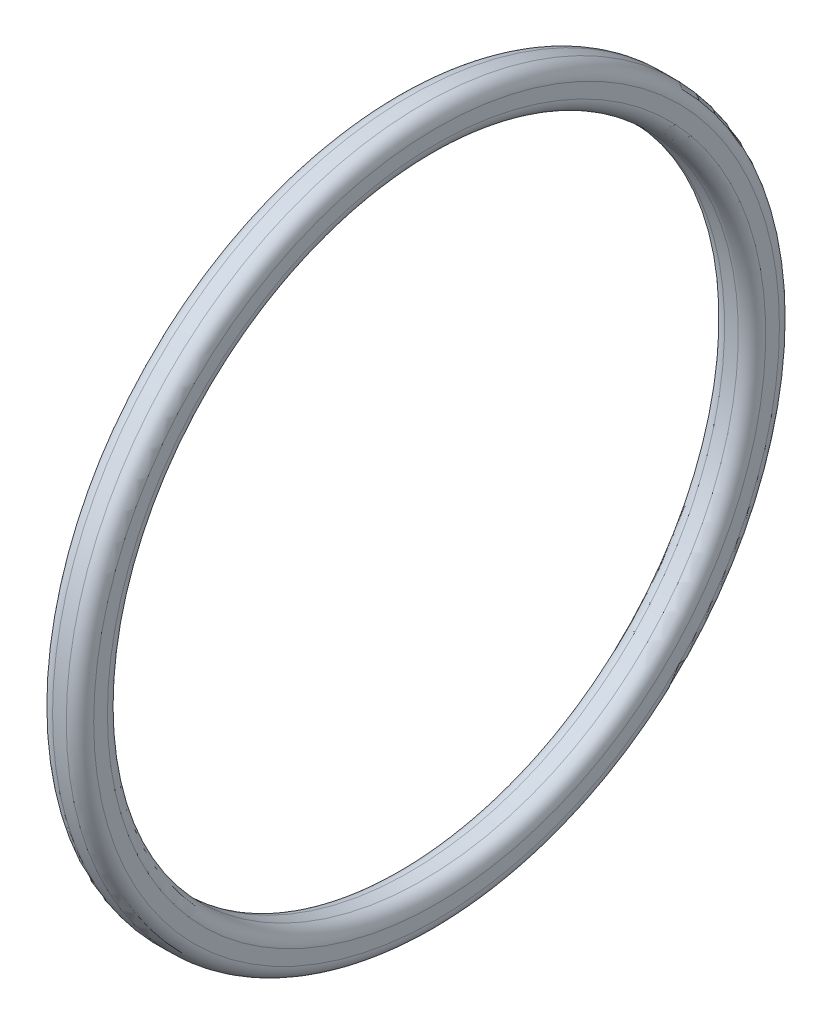
ISO-10303-21;
HEADER;
FILE_DESCRIPTION(('STEP AP214'),'2;1');
FILE_NAME('part.step','',(''),(''),'','','');
FILE_SCHEMA(('AUTOMOTIVE_DESIGN { 1 0 10303 214 1 1 1 1 }'));
ENDSEC;
DATA;
#1=APPLICATION_CONTEXT('core data for automotive mechanical design processes');
#2=APPLICATION_PROTOCOL_DEFINITION('international standard','automotive_design',2000,#1);
#3=PRODUCT_CONTEXT('',#1,'mechanical');
#4=PRODUCT('Part','Part','',(#3));
#5=PRODUCT_RELATED_PRODUCT_CATEGORY('part','',(#4));
#6=PRODUCT_DEFINITION_FORMATION('','',#4);
#7=PRODUCT_DEFINITION_CONTEXT('part definition',#1,'design');
#8=PRODUCT_DEFINITION('design','',#6,#7);
#9=PRODUCT_DEFINITION_SHAPE('','',#8);
#10=(LENGTH_UNIT() NAMED_UNIT(*) SI_UNIT(.MILLI.,.METRE.));
#11=(NAMED_UNIT(*) PLANE_ANGLE_UNIT() SI_UNIT($,.RADIAN.));
#12=(NAMED_UNIT(*) SI_UNIT($,.STERADIAN.) SOLID_ANGLE_UNIT());
#13=UNCERTAINTY_MEASURE_WITH_UNIT(LENGTH_MEASURE(1.E-05),#10,'distance_accuracy_value','');
#14=(GEOMETRIC_REPRESENTATION_CONTEXT(3) GLOBAL_UNCERTAINTY_ASSIGNED_CONTEXT((#13)) GLOBAL_UNIT_ASSIGNED_CONTEXT((#10,
#11,#12)) REPRESENTATION_CONTEXT('',''));
#15=CARTESIAN_POINT('',(0.,0.,0.));
#16=DIRECTION('',(0.,0.,1.));
#17=DIRECTION('',(1.,0.,0.));
#18=AXIS2_PLACEMENT_3D('',#15,#16,#17);
#19=CARTESIAN_POINT('',(1.,0.,0.));
#20=DIRECTION('',(-1.,0.,0.));
#21=DIRECTION('',(0.,0.,1.));
#22=AXIS2_PLACEMENT_3D('',#19,#20,#21);
#23=TOROIDAL_SURFACE('',#22,12.,0.5);
#24=CARTESIAN_POINT('',(1.5,0.,0.));
#25=DIRECTION('',(-1.,0.,0.));
#26=DIRECTION('',(0.,0.,1.));
#27=AXIS2_PLACEMENT_3D('',#24,#25,#26);
#28=CIRCLE('',#27,12.);
#29=CARTESIAN_POINT('',(1.5,0.,12.));
#30=VERTEX_POINT('',#29);
#31=EDGE_CURVE('E56',#30,#30,#28,.T.);
#32=ORIENTED_EDGE('',*,*,#31,.F.);
#33=EDGE_LOOP('',(#32));
#34=FACE_BOUND('',#33,.T.);
#35=CARTESIAN_POINT('',(1.,0.,0.));
#36=DIRECTION('',(-1.,0.,0.));
#37=DIRECTION('',(0.,0.,1.));
#38=AXIS2_PLACEMENT_3D('',#35,#36,#37);
#39=CIRCLE('',#38,11.5);
#40=CARTESIAN_POINT('',(1.,0.,11.5));
#41=VERTEX_POINT('',#40);
#42=EDGE_CURVE('E10',#41,#41,#39,.T.);
#43=ORIENTED_EDGE('',*,*,#42,.T.);
#44=EDGE_LOOP('',(#43));
#45=FACE_BOUND('',#44,.T.);
#46=ADVANCED_FACE('F28',(#34,#45),#23,.T.);
#47=CARTESIAN_POINT('',(-12.3320364238411,0.,0.));
#48=DIRECTION('',(-1.,0.,0.));
#49=DIRECTION('',(0.,0.,1.));
#50=AXIS2_PLACEMENT_3D('',#47,#48,#49);
#51=CYLINDRICAL_SURFACE('',#50,11.5);
#52=ORIENTED_EDGE('',*,*,#42,.F.);
#53=EDGE_LOOP('',(#52));
#54=FACE_BOUND('',#53,.T.);
#55=CARTESIAN_POINT('',(0.5,0.,0.));
#56=DIRECTION('',(-1.,0.,0.));
#57=DIRECTION('',(0.,0.,1.));
#58=AXIS2_PLACEMENT_3D('',#55,#56,#57);
#59=CIRCLE('',#58,11.5);
#60=CARTESIAN_POINT('',(0.5,0.,11.5));
#61=VERTEX_POINT('',#60);
#62=EDGE_CURVE('E34',#61,#61,#59,.T.);
#63=ORIENTED_EDGE('',*,*,#62,.T.);
#64=EDGE_LOOP('',(#63));
#65=FACE_BOUND('',#64,.T.);
#66=ADVANCED_FACE('F63',(#54,#65),#51,.F.);
#67=CARTESIAN_POINT('',(0.5,0.,0.));
#68=DIRECTION('',(-1.,0.,0.));
#69=DIRECTION('',(0.,0.,1.));
#70=AXIS2_PLACEMENT_3D('',#67,#68,#69);
#71=TOROIDAL_SURFACE('',#70,12.,0.5);
#72=ORIENTED_EDGE('',*,*,#62,.F.);
#73=EDGE_LOOP('',(#72));
#74=FACE_BOUND('',#73,.T.);
#75=CARTESIAN_POINT('',(0.,0.,0.));
#76=DIRECTION('',(-1.,0.,0.));
#77=DIRECTION('',(0.,0.,1.));
#78=AXIS2_PLACEMENT_3D('',#75,#76,#77);
#79=CIRCLE('',#78,12.);
#80=CARTESIAN_POINT('',(0.,0.,12.));
#81=VERTEX_POINT('',#80);
#82=EDGE_CURVE('E38',#81,#81,#79,.T.);
#83=ORIENTED_EDGE('',*,*,#82,.T.);
#84=EDGE_LOOP('',(#83));
#85=FACE_BOUND('',#84,.T.);
#86=ADVANCED_FACE('F67',(#74,#85),#71,.T.);
#87=CARTESIAN_POINT('',(0.,12.,0.));
#88=DIRECTION('',(1.,0.,0.));
#89=DIRECTION('',(0.,0.,-1.));
#90=AXIS2_PLACEMENT_3D('',#87,#88,#89);
#91=PLANE('',#90);
#92=ORIENTED_EDGE('',*,*,#82,.F.);
#93=EDGE_LOOP('',(#92));
#94=FACE_BOUND('',#93,.T.);
#95=CARTESIAN_POINT('',(0.,0.,0.));
#96=DIRECTION('',(-1.,0.,0.));
#97=DIRECTION('',(0.,0.,1.));
#98=AXIS2_PLACEMENT_3D('',#95,#96,#97);
#99=CIRCLE('',#98,12.5);
#100=CARTESIAN_POINT('',(0.,0.,12.5));
#101=VERTEX_POINT('',#100);
#102=EDGE_CURVE('E42',#101,#101,#99,.T.);
#103=ORIENTED_EDGE('',*,*,#102,.T.);
#104=EDGE_LOOP('',(#103));
#105=FACE_BOUND('',#104,.T.);
#106=ADVANCED_FACE('F72',(#94,#105),#91,.F.);
#107=CARTESIAN_POINT('',(0.5,0.,0.));
#108=DIRECTION('',(-1.,0.,0.));
#109=DIRECTION('',(0.,0.,1.));
#110=AXIS2_PLACEMENT_3D('',#107,#108,#109);
#111=TOROIDAL_SURFACE('',#110,12.5,0.5);
#112=ORIENTED_EDGE('',*,*,#102,.F.);
#113=EDGE_LOOP('',(#112));
#114=FACE_BOUND('',#113,.T.);
#115=CARTESIAN_POINT('',(0.5,0.,0.));
#116=DIRECTION('',(-1.,0.,0.));
#117=DIRECTION('',(0.,0.,1.));
#118=AXIS2_PLACEMENT_3D('',#115,#116,#117);
#119=CIRCLE('',#118,13.);
#120=CARTESIAN_POINT('',(0.5,0.,13.));
#121=VERTEX_POINT('',#120);
#122=EDGE_CURVE('E47',#121,#121,#119,.T.);
#123=ORIENTED_EDGE('',*,*,#122,.T.);
#124=EDGE_LOOP('',(#123));
#125=FACE_BOUND('',#124,.T.);
#126=ADVANCED_FACE('F78',(#114,#125),#111,.T.);
#127=CARTESIAN_POINT('',(-12.3320364238411,0.,0.));
#128=DIRECTION('',(-1.,0.,0.));
#129=DIRECTION('',(0.,0.,1.));
#130=AXIS2_PLACEMENT_3D('',#127,#128,#129);
#131=CYLINDRICAL_SURFACE('',#130,13.);
#132=ORIENTED_EDGE('',*,*,#122,.F.);
#133=EDGE_LOOP('',(#132));
#134=FACE_BOUND('',#133,.T.);
#135=CARTESIAN_POINT('',(1.,0.,0.));
#136=DIRECTION('',(-1.,0.,0.));
#137=DIRECTION('',(0.,0.,1.));
#138=AXIS2_PLACEMENT_3D('',#135,#136,#137);
#139=CIRCLE('',#138,13.);
#140=CARTESIAN_POINT('',(1.,0.,13.));
#141=VERTEX_POINT('',#140);
#142=EDGE_CURVE('E50',#141,#141,#139,.T.);
#143=ORIENTED_EDGE('',*,*,#142,.T.);
#144=EDGE_LOOP('',(#143));
#145=FACE_BOUND('',#144,.T.);
#146=ADVANCED_FACE('F82',(#134,#145),#131,.T.);
#147=CARTESIAN_POINT('',(1.,0.,0.));
#148=DIRECTION('',(-1.,0.,0.));
#149=DIRECTION('',(0.,0.,1.));
#150=AXIS2_PLACEMENT_3D('',#147,#148,#149);
#151=TOROIDAL_SURFACE('',#150,12.5,0.499999999999999);
#152=ORIENTED_EDGE('',*,*,#142,.F.);
#153=EDGE_LOOP('',(#152));
#154=FACE_BOUND('',#153,.T.);
#155=CARTESIAN_POINT('',(1.5,0.,0.));
#156=DIRECTION('',(-1.,0.,0.));
#157=DIRECTION('',(0.,0.,1.));
#158=AXIS2_PLACEMENT_3D('',#155,#156,#157);
#159=CIRCLE('',#158,12.5);
#160=CARTESIAN_POINT('',(1.5,0.,12.5));
#161=VERTEX_POINT('',#160);
#162=EDGE_CURVE('E53',#161,#161,#159,.T.);
#163=ORIENTED_EDGE('',*,*,#162,.T.);
#164=EDGE_LOOP('',(#163));
#165=FACE_BOUND('',#164,.T.);
#166=ADVANCED_FACE('F86',(#154,#165),#151,.T.);
#167=CARTESIAN_POINT('',(1.5,12.,0.));
#168=DIRECTION('',(-1.,0.,0.));
#169=DIRECTION('',(0.,0.,1.));
#170=AXIS2_PLACEMENT_3D('',#167,#168,#169);
#171=PLANE('',#170);
#172=ORIENTED_EDGE('',*,*,#162,.F.);
#173=EDGE_LOOP('',(#172));
#174=FACE_BOUND('',#173,.T.);
#175=ORIENTED_EDGE('',*,*,#31,.T.);
#176=EDGE_LOOP('',(#175));
#177=FACE_BOUND('',#176,.T.);
#178=ADVANCED_FACE('F60',(#174,#177),#171,.F.);
#179=CLOSED_SHELL('',(#46,#66,#86,#106,#126,#146,#166,#178));
#180=MANIFOLD_SOLID_BREP('B2',#179);
#181=ADVANCED_BREP_SHAPE_REPRESENTATION('',(#18,#180),#14);
#182=SHAPE_DEFINITION_REPRESENTATION(#9,#181);
ENDSEC;
END-ISO-10303-21;
